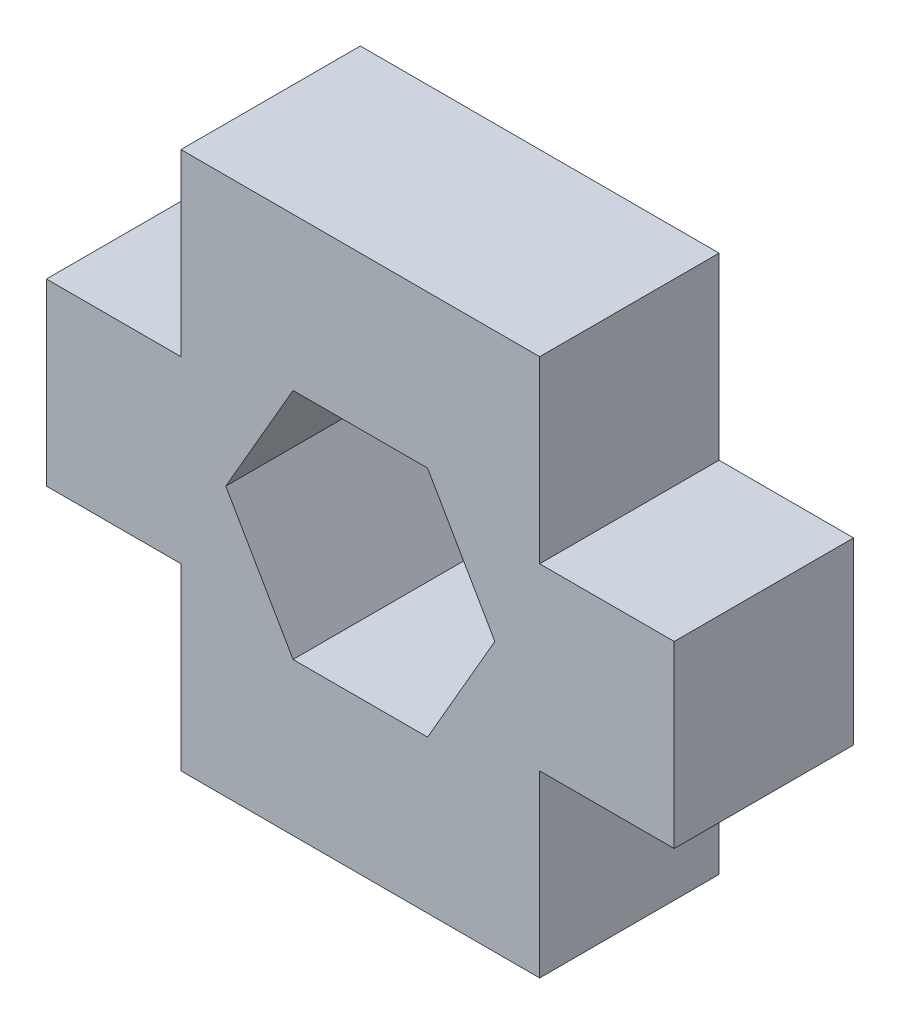
ISO-10303-21;
HEADER;
FILE_DESCRIPTION(('STEP AP214'),'2;1');
FILE_NAME('part.step','',(''),(''),'','','');
FILE_SCHEMA(('AUTOMOTIVE_DESIGN { 1 0 10303 214 1 1 1 1 }'));
ENDSEC;
DATA;
#1=APPLICATION_CONTEXT('core data for automotive mechanical design processes');
#2=APPLICATION_PROTOCOL_DEFINITION('international standard','automotive_design',2000,#1);
#3=PRODUCT_CONTEXT('',#1,'mechanical');
#4=PRODUCT('Part','Part','',(#3));
#5=PRODUCT_RELATED_PRODUCT_CATEGORY('part','',(#4));
#6=PRODUCT_DEFINITION_FORMATION('','',#4);
#7=PRODUCT_DEFINITION_CONTEXT('part definition',#1,'design');
#8=PRODUCT_DEFINITION('design','',#6,#7);
#9=PRODUCT_DEFINITION_SHAPE('','',#8);
#10=(LENGTH_UNIT() NAMED_UNIT(*) SI_UNIT(.MILLI.,.METRE.));
#11=(NAMED_UNIT(*) PLANE_ANGLE_UNIT() SI_UNIT($,.RADIAN.));
#12=(NAMED_UNIT(*) SI_UNIT($,.STERADIAN.) SOLID_ANGLE_UNIT());
#13=UNCERTAINTY_MEASURE_WITH_UNIT(LENGTH_MEASURE(1.E-05),#10,'distance_accuracy_value','');
#14=(GEOMETRIC_REPRESENTATION_CONTEXT(3) GLOBAL_UNCERTAINTY_ASSIGNED_CONTEXT((#13)) GLOBAL_UNIT_ASSIGNED_CONTEXT((#10,
#11,#12)) REPRESENTATION_CONTEXT('',''));
#15=CARTESIAN_POINT('',(0.,0.,0.));
#16=DIRECTION('',(0.,0.,1.));
#17=DIRECTION('',(1.,0.,0.));
#18=AXIS2_PLACEMENT_3D('',#15,#16,#17);
#19=CARTESIAN_POINT('',(0.,0.,4.));
#20=DIRECTION('',(0.,0.,1.));
#21=DIRECTION('',(1.,0.,0.));
#22=AXIS2_PLACEMENT_3D('',#19,#20,#21);
#23=PLANE('',#22);
#24=DIRECTION('',(0.,-1.,0.));
#25=VECTOR('',#24,1.);
#26=CARTESIAN_POINT('',(0.,4.,4.));
#27=LINE('',#26,#25);
#28=CARTESIAN_POINT('',(0.,4.,4.));
#29=VERTEX_POINT('',#28);
#30=CARTESIAN_POINT('',(0.,0.,4.));
#31=VERTEX_POINT('',#30);
#32=EDGE_CURVE('E208',#29,#31,#27,.T.);
#33=ORIENTED_EDGE('',*,*,#32,.T.);
#34=DIRECTION('',(1.,0.,0.));
#35=VECTOR('',#34,1.);
#36=CARTESIAN_POINT('',(0.,0.,4.));
#37=LINE('',#36,#35);
#38=CARTESIAN_POINT('',(8.,0.,4.));
#39=VERTEX_POINT('',#38);
#40=EDGE_CURVE('E211',#31,#39,#37,.T.);
#41=ORIENTED_EDGE('',*,*,#40,.T.);
#42=DIRECTION('',(0.,1.,0.));
#43=VECTOR('',#42,1.);
#44=CARTESIAN_POINT('',(8.,0.,4.));
#45=LINE('',#44,#43);
#46=CARTESIAN_POINT('',(8.,4.,4.));
#47=VERTEX_POINT('',#46);
#48=EDGE_CURVE('E214',#39,#47,#45,.T.);
#49=ORIENTED_EDGE('',*,*,#48,.T.);
#50=DIRECTION('',(1.,0.,0.));
#51=VECTOR('',#50,1.);
#52=CARTESIAN_POINT('',(8.,4.,4.));
#53=LINE('',#52,#51);
#54=CARTESIAN_POINT('',(11.,4.,4.));
#55=VERTEX_POINT('',#54);
#56=EDGE_CURVE('E216',#47,#55,#53,.T.);
#57=ORIENTED_EDGE('',*,*,#56,.T.);
#58=DIRECTION('',(0.,1.,0.));
#59=VECTOR('',#58,1.);
#60=CARTESIAN_POINT('',(11.,4.,4.));
#61=LINE('',#60,#59);
#62=CARTESIAN_POINT('',(11.,8.,4.));
#63=VERTEX_POINT('',#62);
#64=EDGE_CURVE('E218',#55,#63,#61,.T.);
#65=ORIENTED_EDGE('',*,*,#64,.T.);
#66=DIRECTION('',(-1.,0.,0.));
#67=VECTOR('',#66,1.);
#68=CARTESIAN_POINT('',(8.,8.,4.));
#69=LINE('',#68,#67);
#70=CARTESIAN_POINT('',(8.,8.,4.));
#71=VERTEX_POINT('',#70);
#72=EDGE_CURVE('E220',#63,#71,#69,.T.);
#73=ORIENTED_EDGE('',*,*,#72,.T.);
#74=DIRECTION('',(0.,1.,0.));
#75=VECTOR('',#74,1.);
#76=CARTESIAN_POINT('',(8.,8.,4.));
#77=LINE('',#76,#75);
#78=CARTESIAN_POINT('',(8.,12.,4.));
#79=VERTEX_POINT('',#78);
#80=EDGE_CURVE('E222',#71,#79,#77,.T.);
#81=ORIENTED_EDGE('',*,*,#80,.T.);
#82=DIRECTION('',(-1.,0.,0.));
#83=VECTOR('',#82,1.);
#84=CARTESIAN_POINT('',(8.,12.,4.));
#85=LINE('',#84,#83);
#86=CARTESIAN_POINT('',(0.,12.,4.));
#87=VERTEX_POINT('',#86);
#88=EDGE_CURVE('E224',#79,#87,#85,.T.);
#89=ORIENTED_EDGE('',*,*,#88,.T.);
#90=DIRECTION('',(0.,-1.,0.));
#91=VECTOR('',#90,1.);
#92=CARTESIAN_POINT('',(0.,12.,4.));
#93=LINE('',#92,#91);
#94=CARTESIAN_POINT('',(0.,8.,4.));
#95=VERTEX_POINT('',#94);
#96=EDGE_CURVE('E226',#87,#95,#93,.T.);
#97=ORIENTED_EDGE('',*,*,#96,.T.);
#98=DIRECTION('',(-1.,0.,0.));
#99=VECTOR('',#98,1.);
#100=CARTESIAN_POINT('',(0.,8.,4.));
#101=LINE('',#100,#99);
#102=CARTESIAN_POINT('',(-3.,8.,4.));
#103=VERTEX_POINT('',#102);
#104=EDGE_CURVE('E228',#95,#103,#101,.T.);
#105=ORIENTED_EDGE('',*,*,#104,.T.);
#106=DIRECTION('',(0.,-1.,0.));
#107=VECTOR('',#106,1.);
#108=CARTESIAN_POINT('',(-3.,8.,4.));
#109=LINE('',#108,#107);
#110=CARTESIAN_POINT('',(-3.,4.,4.));
#111=VERTEX_POINT('',#110);
#112=EDGE_CURVE('E230',#103,#111,#109,.T.);
#113=ORIENTED_EDGE('',*,*,#112,.T.);
#114=DIRECTION('',(1.,0.,0.));
#115=VECTOR('',#114,1.);
#116=CARTESIAN_POINT('',(-3.,4.,4.));
#117=LINE('',#116,#115);
#118=EDGE_CURVE('E232',#111,#29,#117,.T.);
#119=ORIENTED_EDGE('',*,*,#118,.T.);
#120=EDGE_LOOP('',(#33,#41,#49,#57,#65,#73,#81,#89,#97,#105,#113,#119));
#121=FACE_BOUND('',#120,.T.);
#122=DIRECTION('',(-0.5,0.866025403784439,0.));
#123=VECTOR('',#122,1.);
#124=CARTESIAN_POINT('',(7.00000000000003,5.99999999999998,4.));
#125=LINE('',#124,#123);
#126=CARTESIAN_POINT('',(7.00000000000003,5.99999999999998,4.));
#127=VERTEX_POINT('',#126);
#128=CARTESIAN_POINT('',(5.50000000000002,8.59807621135331,4.));
#129=VERTEX_POINT('',#128);
#130=EDGE_CURVE('E165',#127,#129,#125,.T.);
#131=ORIENTED_EDGE('',*,*,#130,.F.);
#132=DIRECTION('',(0.5,0.866025403784439,0.));
#133=VECTOR('',#132,1.);
#134=CARTESIAN_POINT('',(5.50000000000002,3.40192378864665,4.));
#135=LINE('',#134,#133);
#136=CARTESIAN_POINT('',(5.50000000000002,3.40192378864665,4.));
#137=VERTEX_POINT('',#136);
#138=EDGE_CURVE('E157',#137,#127,#135,.T.);
#139=ORIENTED_EDGE('',*,*,#138,.F.);
#140=DIRECTION('',(1.,0.,0.));
#141=VECTOR('',#140,1.);
#142=CARTESIAN_POINT('',(2.50000000000001,3.40192378864666,4.));
#143=LINE('',#142,#141);
#144=CARTESIAN_POINT('',(2.50000000000001,3.40192378864666,4.));
#145=VERTEX_POINT('',#144);
#146=EDGE_CURVE('E186',#145,#137,#143,.T.);
#147=ORIENTED_EDGE('',*,*,#146,.F.);
#148=DIRECTION('',(0.5,-0.866025403784438,0.));
#149=VECTOR('',#148,1.);
#150=CARTESIAN_POINT('',(1.,5.99999999999998,4.));
#151=LINE('',#150,#149);
#152=CARTESIAN_POINT('',(1.,5.99999999999998,4.));
#153=VERTEX_POINT('',#152);
#154=EDGE_CURVE('E184',#153,#145,#151,.T.);
#155=ORIENTED_EDGE('',*,*,#154,.F.);
#156=DIRECTION('',(-0.5,-0.866025403784439,0.));
#157=VECTOR('',#156,1.);
#158=CARTESIAN_POINT('',(2.50000000000001,8.59807621135331,4.));
#159=LINE('',#158,#157);
#160=CARTESIAN_POINT('',(2.50000000000001,8.59807621135331,4.));
#161=VERTEX_POINT('',#160);
#162=EDGE_CURVE('E180',#161,#153,#159,.T.);
#163=ORIENTED_EDGE('',*,*,#162,.F.);
#164=DIRECTION('',(-1.,0.,0.));
#165=VECTOR('',#164,1.);
#166=CARTESIAN_POINT('',(5.50000000000002,8.59807621135331,4.));
#167=LINE('',#166,#165);
#168=EDGE_CURVE('E178',#129,#161,#167,.T.);
#169=ORIENTED_EDGE('',*,*,#168,.F.);
#170=EDGE_LOOP('',(#131,#139,#147,#155,#163,#169));
#171=FACE_BOUND('',#170,.T.);
#172=ADVANCED_FACE('F32',(#121,#171),#23,.T.);
#173=CARTESIAN_POINT('',(0.,0.,0.));
#174=DIRECTION('',(0.,0.,1.));
#175=DIRECTION('',(1.,0.,0.));
#176=AXIS2_PLACEMENT_3D('',#173,#174,#175);
#177=PLANE('',#176);
#178=DIRECTION('',(0.,-1.,0.));
#179=VECTOR('',#178,1.);
#180=CARTESIAN_POINT('',(0.,4.,0.));
#181=LINE('',#180,#179);
#182=CARTESIAN_POINT('',(0.,4.,0.));
#183=VERTEX_POINT('',#182);
#184=CARTESIAN_POINT('',(0.,0.,0.));
#185=VERTEX_POINT('',#184);
#186=EDGE_CURVE('E173',#183,#185,#181,.T.);
#187=ORIENTED_EDGE('',*,*,#186,.F.);
#188=DIRECTION('',(1.,0.,0.));
#189=VECTOR('',#188,1.);
#190=CARTESIAN_POINT('',(-3.,4.,0.));
#191=LINE('',#190,#189);
#192=CARTESIAN_POINT('',(-3.,4.,0.));
#193=VERTEX_POINT('',#192);
#194=EDGE_CURVE('E212',#193,#183,#191,.T.);
#195=ORIENTED_EDGE('',*,*,#194,.F.);
#196=DIRECTION('',(0.,-1.,0.));
#197=VECTOR('',#196,1.);
#198=CARTESIAN_POINT('',(-3.,8.,0.));
#199=LINE('',#198,#197);
#200=CARTESIAN_POINT('',(-3.,8.,0.));
#201=VERTEX_POINT('',#200);
#202=EDGE_CURVE('E255',#201,#193,#199,.T.);
#203=ORIENTED_EDGE('',*,*,#202,.F.);
#204=DIRECTION('',(-1.,0.,0.));
#205=VECTOR('',#204,1.);
#206=CARTESIAN_POINT('',(0.,8.,0.));
#207=LINE('',#206,#205);
#208=CARTESIAN_POINT('',(0.,8.,0.));
#209=VERTEX_POINT('',#208);
#210=EDGE_CURVE('E253',#209,#201,#207,.T.);
#211=ORIENTED_EDGE('',*,*,#210,.F.);
#212=DIRECTION('',(0.,-1.,0.));
#213=VECTOR('',#212,1.);
#214=CARTESIAN_POINT('',(0.,12.,0.));
#215=LINE('',#214,#213);
#216=CARTESIAN_POINT('',(0.,12.,0.));
#217=VERTEX_POINT('',#216);
#218=EDGE_CURVE('E251',#217,#209,#215,.T.);
#219=ORIENTED_EDGE('',*,*,#218,.F.);
#220=DIRECTION('',(-1.,0.,0.));
#221=VECTOR('',#220,1.);
#222=CARTESIAN_POINT('',(8.,12.,0.));
#223=LINE('',#222,#221);
#224=CARTESIAN_POINT('',(8.,12.,0.));
#225=VERTEX_POINT('',#224);
#226=EDGE_CURVE('E249',#225,#217,#223,.T.);
#227=ORIENTED_EDGE('',*,*,#226,.F.);
#228=DIRECTION('',(0.,1.,0.));
#229=VECTOR('',#228,1.);
#230=CARTESIAN_POINT('',(8.,8.,0.));
#231=LINE('',#230,#229);
#232=CARTESIAN_POINT('',(8.,8.,0.));
#233=VERTEX_POINT('',#232);
#234=EDGE_CURVE('E247',#233,#225,#231,.T.);
#235=ORIENTED_EDGE('',*,*,#234,.F.);
#236=DIRECTION('',(-1.,0.,0.));
#237=VECTOR('',#236,1.);
#238=CARTESIAN_POINT('',(8.,8.,0.));
#239=LINE('',#238,#237);
#240=CARTESIAN_POINT('',(11.,8.,0.));
#241=VERTEX_POINT('',#240);
#242=EDGE_CURVE('E245',#241,#233,#239,.T.);
#243=ORIENTED_EDGE('',*,*,#242,.F.);
#244=DIRECTION('',(0.,1.,0.));
#245=VECTOR('',#244,1.);
#246=CARTESIAN_POINT('',(11.,4.,0.));
#247=LINE('',#246,#245);
#248=CARTESIAN_POINT('',(11.,4.,0.));
#249=VERTEX_POINT('',#248);
#250=EDGE_CURVE('E243',#249,#241,#247,.T.);
#251=ORIENTED_EDGE('',*,*,#250,.F.);
#252=DIRECTION('',(1.,0.,0.));
#253=VECTOR('',#252,1.);
#254=CARTESIAN_POINT('',(8.,4.,0.));
#255=LINE('',#254,#253);
#256=CARTESIAN_POINT('',(8.,4.,0.));
#257=VERTEX_POINT('',#256);
#258=EDGE_CURVE('E241',#257,#249,#255,.T.);
#259=ORIENTED_EDGE('',*,*,#258,.F.);
#260=DIRECTION('',(0.,1.,0.));
#261=VECTOR('',#260,1.);
#262=CARTESIAN_POINT('',(8.,0.,0.));
#263=LINE('',#262,#261);
#264=CARTESIAN_POINT('',(8.,0.,0.));
#265=VERTEX_POINT('',#264);
#266=EDGE_CURVE('E239',#265,#257,#263,.T.);
#267=ORIENTED_EDGE('',*,*,#266,.F.);
#268=DIRECTION('',(1.,0.,0.));
#269=VECTOR('',#268,1.);
#270=CARTESIAN_POINT('',(0.,0.,0.));
#271=LINE('',#270,#269);
#272=EDGE_CURVE('E237',#185,#265,#271,.T.);
#273=ORIENTED_EDGE('',*,*,#272,.F.);
#274=EDGE_LOOP('',(#187,#195,#203,#211,#219,#227,#235,#243,#251,#259,#267,#273));
#275=FACE_BOUND('',#274,.T.);
#276=DIRECTION('',(0.5,0.866025403784439,0.));
#277=VECTOR('',#276,1.);
#278=CARTESIAN_POINT('',(5.50000000000002,3.40192378864665,0.));
#279=LINE('',#278,#277);
#280=CARTESIAN_POINT('',(5.50000000000002,3.40192378864665,0.));
#281=VERTEX_POINT('',#280);
#282=CARTESIAN_POINT('',(7.00000000000003,5.99999999999998,0.));
#283=VERTEX_POINT('',#282);
#284=EDGE_CURVE('E55',#281,#283,#279,.T.);
#285=ORIENTED_EDGE('',*,*,#284,.T.);
#286=DIRECTION('',(-0.5,0.866025403784439,0.));
#287=VECTOR('',#286,1.);
#288=CARTESIAN_POINT('',(7.00000000000003,5.99999999999998,0.));
#289=LINE('',#288,#287);
#290=CARTESIAN_POINT('',(5.50000000000002,8.59807621135331,0.));
#291=VERTEX_POINT('',#290);
#292=EDGE_CURVE('E172',#283,#291,#289,.T.);
#293=ORIENTED_EDGE('',*,*,#292,.T.);
#294=DIRECTION('',(-1.,0.,0.));
#295=VECTOR('',#294,1.);
#296=CARTESIAN_POINT('',(5.50000000000002,8.59807621135331,0.));
#297=LINE('',#296,#295);
#298=CARTESIAN_POINT('',(2.50000000000001,8.59807621135331,0.));
#299=VERTEX_POINT('',#298);
#300=EDGE_CURVE('E190',#291,#299,#297,.T.);
#301=ORIENTED_EDGE('',*,*,#300,.T.);
#302=DIRECTION('',(-0.5,-0.866025403784439,0.));
#303=VECTOR('',#302,1.);
#304=CARTESIAN_POINT('',(2.50000000000001,8.59807621135331,0.));
#305=LINE('',#304,#303);
#306=CARTESIAN_POINT('',(1.,5.99999999999998,0.));
#307=VERTEX_POINT('',#306);
#308=EDGE_CURVE('E193',#299,#307,#305,.T.);
#309=ORIENTED_EDGE('',*,*,#308,.T.);
#310=DIRECTION('',(0.5,-0.866025403784438,0.));
#311=VECTOR('',#310,1.);
#312=CARTESIAN_POINT('',(1.,5.99999999999998,0.));
#313=LINE('',#312,#311);
#314=CARTESIAN_POINT('',(2.50000000000001,3.40192378864666,0.));
#315=VERTEX_POINT('',#314);
#316=EDGE_CURVE('E196',#307,#315,#313,.T.);
#317=ORIENTED_EDGE('',*,*,#316,.T.);
#318=DIRECTION('',(1.,0.,0.));
#319=VECTOR('',#318,1.);
#320=CARTESIAN_POINT('',(2.50000000000001,3.40192378864666,0.));
#321=LINE('',#320,#319);
#322=EDGE_CURVE('E166',#315,#281,#321,.T.);
#323=ORIENTED_EDGE('',*,*,#322,.T.);
#324=EDGE_LOOP('',(#285,#293,#301,#309,#317,#323));
#325=FACE_BOUND('',#324,.T.);
#326=ADVANCED_FACE('F297',(#275,#325),#177,.F.);
#327=CARTESIAN_POINT('',(0.,4.,4.));
#328=DIRECTION('',(1.,0.,0.));
#329=DIRECTION('',(0.,0.,-1.));
#330=AXIS2_PLACEMENT_3D('',#327,#328,#329);
#331=PLANE('',#330);
#332=ORIENTED_EDGE('',*,*,#186,.T.);
#333=DIRECTION('',(0.,0.,-1.));
#334=VECTOR('',#333,1.);
#335=CARTESIAN_POINT('',(0.,0.,4.));
#336=LINE('',#335,#334);
#337=EDGE_CURVE('E11',#31,#185,#336,.T.);
#338=ORIENTED_EDGE('',*,*,#337,.F.);
#339=ORIENTED_EDGE('',*,*,#32,.F.);
#340=DIRECTION('',(0.,0.,-1.));
#341=VECTOR('',#340,1.);
#342=CARTESIAN_POINT('',(0.,4.,4.));
#343=LINE('',#342,#341);
#344=EDGE_CURVE('E234',#29,#183,#343,.T.);
#345=ORIENTED_EDGE('',*,*,#344,.T.);
#346=EDGE_LOOP('',(#332,#338,#339,#345));
#347=FACE_BOUND('',#346,.T.);
#348=ADVANCED_FACE('F34',(#347),#331,.F.);
#349=CARTESIAN_POINT('',(0.,0.,4.));
#350=DIRECTION('',(0.,1.,0.));
#351=DIRECTION('',(0.,0.,1.));
#352=AXIS2_PLACEMENT_3D('',#349,#350,#351);
#353=PLANE('',#352);
#354=ORIENTED_EDGE('',*,*,#272,.T.);
#355=DIRECTION('',(0.,0.,-1.));
#356=VECTOR('',#355,1.);
#357=CARTESIAN_POINT('',(8.,0.,4.));
#358=LINE('',#357,#356);
#359=EDGE_CURVE('E40',#39,#265,#358,.T.);
#360=ORIENTED_EDGE('',*,*,#359,.F.);
#361=ORIENTED_EDGE('',*,*,#40,.F.);
#362=ORIENTED_EDGE('',*,*,#337,.T.);
#363=EDGE_LOOP('',(#354,#360,#361,#362));
#364=FACE_BOUND('',#363,.T.);
#365=ADVANCED_FACE('F314',(#364),#353,.F.);
#366=CARTESIAN_POINT('',(8.,0.,4.));
#367=DIRECTION('',(-1.,0.,0.));
#368=DIRECTION('',(0.,0.,1.));
#369=AXIS2_PLACEMENT_3D('',#366,#367,#368);
#370=PLANE('',#369);
#371=ORIENTED_EDGE('',*,*,#266,.T.);
#372=DIRECTION('',(0.,0.,-1.));
#373=VECTOR('',#372,1.);
#374=CARTESIAN_POINT('',(8.,4.,4.));
#375=LINE('',#374,#373);
#376=EDGE_CURVE('E284',#47,#257,#375,.T.);
#377=ORIENTED_EDGE('',*,*,#376,.F.);
#378=ORIENTED_EDGE('',*,*,#48,.F.);
#379=ORIENTED_EDGE('',*,*,#359,.T.);
#380=EDGE_LOOP('',(#371,#377,#378,#379));
#381=FACE_BOUND('',#380,.T.);
#382=ADVANCED_FACE('F291',(#381),#370,.F.);
#383=CARTESIAN_POINT('',(8.,4.,4.));
#384=DIRECTION('',(0.,1.,0.));
#385=DIRECTION('',(-1.,0.,0.));
#386=AXIS2_PLACEMENT_3D('',#383,#384,#385);
#387=PLANE('',#386);
#388=ORIENTED_EDGE('',*,*,#258,.T.);
#389=DIRECTION('',(0.,0.,-1.));
#390=VECTOR('',#389,1.);
#391=CARTESIAN_POINT('',(11.,4.,4.));
#392=LINE('',#391,#390);
#393=EDGE_CURVE('E281',#55,#249,#392,.T.);
#394=ORIENTED_EDGE('',*,*,#393,.F.);
#395=ORIENTED_EDGE('',*,*,#56,.F.);
#396=ORIENTED_EDGE('',*,*,#376,.T.);
#397=EDGE_LOOP('',(#388,#394,#395,#396));
#398=FACE_BOUND('',#397,.T.);
#399=ADVANCED_FACE('F303',(#398),#387,.F.);
#400=CARTESIAN_POINT('',(11.,4.,4.));
#401=DIRECTION('',(-1.,0.,0.));
#402=DIRECTION('',(0.,0.,1.));
#403=AXIS2_PLACEMENT_3D('',#400,#401,#402);
#404=PLANE('',#403);
#405=ORIENTED_EDGE('',*,*,#250,.T.);
#406=DIRECTION('',(0.,0.,-1.));
#407=VECTOR('',#406,1.);
#408=CARTESIAN_POINT('',(11.,8.,4.));
#409=LINE('',#408,#407);
#410=EDGE_CURVE('E278',#63,#241,#409,.T.);
#411=ORIENTED_EDGE('',*,*,#410,.F.);
#412=ORIENTED_EDGE('',*,*,#64,.F.);
#413=ORIENTED_EDGE('',*,*,#393,.T.);
#414=EDGE_LOOP('',(#405,#411,#412,#413));
#415=FACE_BOUND('',#414,.T.);
#416=ADVANCED_FACE('F307',(#415),#404,.F.);
#417=CARTESIAN_POINT('',(8.,8.,4.));
#418=DIRECTION('',(0.,-1.,0.));
#419=DIRECTION('',(0.,0.,-1.));
#420=AXIS2_PLACEMENT_3D('',#417,#418,#419);
#421=PLANE('',#420);
#422=ORIENTED_EDGE('',*,*,#242,.T.);
#423=DIRECTION('',(0.,0.,-1.));
#424=VECTOR('',#423,1.);
#425=CARTESIAN_POINT('',(8.,8.,4.));
#426=LINE('',#425,#424);
#427=EDGE_CURVE('E275',#71,#233,#426,.T.);
#428=ORIENTED_EDGE('',*,*,#427,.F.);
#429=ORIENTED_EDGE('',*,*,#72,.F.);
#430=ORIENTED_EDGE('',*,*,#410,.T.);
#431=EDGE_LOOP('',(#422,#428,#429,#430));
#432=FACE_BOUND('',#431,.T.);
#433=ADVANCED_FACE('F347',(#432),#421,.F.);
#434=CARTESIAN_POINT('',(8.,8.,4.));
#435=DIRECTION('',(-1.,0.,0.));
#436=DIRECTION('',(0.,0.,1.));
#437=AXIS2_PLACEMENT_3D('',#434,#435,#436);
#438=PLANE('',#437);
#439=ORIENTED_EDGE('',*,*,#234,.T.);
#440=DIRECTION('',(0.,0.,-1.));
#441=VECTOR('',#440,1.);
#442=CARTESIAN_POINT('',(8.,12.,4.));
#443=LINE('',#442,#441);
#444=EDGE_CURVE('E272',#79,#225,#443,.T.);
#445=ORIENTED_EDGE('',*,*,#444,.F.);
#446=ORIENTED_EDGE('',*,*,#80,.F.);
#447=ORIENTED_EDGE('',*,*,#427,.T.);
#448=EDGE_LOOP('',(#439,#445,#446,#447));
#449=FACE_BOUND('',#448,.T.);
#450=ADVANCED_FACE('F345',(#449),#438,.F.);
#451=CARTESIAN_POINT('',(8.,12.,4.));
#452=DIRECTION('',(0.,-1.,0.));
#453=DIRECTION('',(0.,0.,-1.));
#454=AXIS2_PLACEMENT_3D('',#451,#452,#453);
#455=PLANE('',#454);
#456=ORIENTED_EDGE('',*,*,#226,.T.);
#457=DIRECTION('',(0.,0.,-1.));
#458=VECTOR('',#457,1.);
#459=CARTESIAN_POINT('',(0.,12.,4.));
#460=LINE('',#459,#458);
#461=EDGE_CURVE('E269',#87,#217,#460,.T.);
#462=ORIENTED_EDGE('',*,*,#461,.F.);
#463=ORIENTED_EDGE('',*,*,#88,.F.);
#464=ORIENTED_EDGE('',*,*,#444,.T.);
#465=EDGE_LOOP('',(#456,#462,#463,#464));
#466=FACE_BOUND('',#465,.T.);
#467=ADVANCED_FACE('F341',(#466),#455,.F.);
#468=CARTESIAN_POINT('',(0.,12.,4.));
#469=DIRECTION('',(1.,0.,0.));
#470=DIRECTION('',(0.,0.,-1.));
#471=AXIS2_PLACEMENT_3D('',#468,#469,#470);
#472=PLANE('',#471);
#473=ORIENTED_EDGE('',*,*,#218,.T.);
#474=DIRECTION('',(0.,0.,-1.));
#475=VECTOR('',#474,1.);
#476=CARTESIAN_POINT('',(0.,8.,4.));
#477=LINE('',#476,#475);
#478=EDGE_CURVE('E266',#95,#209,#477,.T.);
#479=ORIENTED_EDGE('',*,*,#478,.F.);
#480=ORIENTED_EDGE('',*,*,#96,.F.);
#481=ORIENTED_EDGE('',*,*,#461,.T.);
#482=EDGE_LOOP('',(#473,#479,#480,#481));
#483=FACE_BOUND('',#482,.T.);
#484=ADVANCED_FACE('F336',(#483),#472,.F.);
#485=CARTESIAN_POINT('',(0.,8.,4.));
#486=DIRECTION('',(0.,-1.,0.));
#487=DIRECTION('',(0.,0.,-1.));
#488=AXIS2_PLACEMENT_3D('',#485,#486,#487);
#489=PLANE('',#488);
#490=ORIENTED_EDGE('',*,*,#210,.T.);
#491=DIRECTION('',(0.,0.,-1.));
#492=VECTOR('',#491,1.);
#493=CARTESIAN_POINT('',(-3.,8.,4.));
#494=LINE('',#493,#492);
#495=EDGE_CURVE('E263',#103,#201,#494,.T.);
#496=ORIENTED_EDGE('',*,*,#495,.F.);
#497=ORIENTED_EDGE('',*,*,#104,.F.);
#498=ORIENTED_EDGE('',*,*,#478,.T.);
#499=EDGE_LOOP('',(#490,#496,#497,#498));
#500=FACE_BOUND('',#499,.T.);
#501=ADVANCED_FACE('F330',(#500),#489,.F.);
#502=CARTESIAN_POINT('',(-3.,8.,4.));
#503=DIRECTION('',(1.,0.,0.));
#504=DIRECTION('',(0.,0.,-1.));
#505=AXIS2_PLACEMENT_3D('',#502,#503,#504);
#506=PLANE('',#505);
#507=ORIENTED_EDGE('',*,*,#202,.T.);
#508=DIRECTION('',(0.,0.,-1.));
#509=VECTOR('',#508,1.);
#510=CARTESIAN_POINT('',(-3.,4.,4.));
#511=LINE('',#510,#509);
#512=EDGE_CURVE('E260',#111,#193,#511,.T.);
#513=ORIENTED_EDGE('',*,*,#512,.F.);
#514=ORIENTED_EDGE('',*,*,#112,.F.);
#515=ORIENTED_EDGE('',*,*,#495,.T.);
#516=EDGE_LOOP('',(#507,#513,#514,#515));
#517=FACE_BOUND('',#516,.T.);
#518=ADVANCED_FACE('F326',(#517),#506,.F.);
#519=CARTESIAN_POINT('',(-3.,4.,4.));
#520=DIRECTION('',(0.,1.,0.));
#521=DIRECTION('',(0.,0.,1.));
#522=AXIS2_PLACEMENT_3D('',#519,#520,#521);
#523=PLANE('',#522);
#524=ORIENTED_EDGE('',*,*,#194,.T.);
#525=ORIENTED_EDGE('',*,*,#344,.F.);
#526=ORIENTED_EDGE('',*,*,#118,.F.);
#527=ORIENTED_EDGE('',*,*,#512,.T.);
#528=EDGE_LOOP('',(#524,#525,#526,#527));
#529=FACE_BOUND('',#528,.T.);
#530=ADVANCED_FACE('F321',(#529),#523,.F.);
#531=CARTESIAN_POINT('',(5.50000000000002,3.40192378864665,4.));
#532=DIRECTION('',(-0.866025403784439,0.5,0.));
#533=DIRECTION('',(-0.5,-0.866025403784439,0.));
#534=AXIS2_PLACEMENT_3D('',#531,#532,#533);
#535=PLANE('',#534);
#536=ORIENTED_EDGE('',*,*,#284,.F.);
#537=DIRECTION('',(0.,0.,-1.));
#538=VECTOR('',#537,1.);
#539=CARTESIAN_POINT('',(5.50000000000002,3.40192378864665,4.));
#540=LINE('',#539,#538);
#541=EDGE_CURVE('E161',#137,#281,#540,.T.);
#542=ORIENTED_EDGE('',*,*,#541,.F.);
#543=ORIENTED_EDGE('',*,*,#138,.T.);
#544=DIRECTION('',(0.,0.,-1.));
#545=VECTOR('',#544,1.);
#546=CARTESIAN_POINT('',(7.00000000000003,5.99999999999998,4.));
#547=LINE('',#546,#545);
#548=EDGE_CURVE('E160',#127,#283,#547,.T.);
#549=ORIENTED_EDGE('',*,*,#548,.T.);
#550=EDGE_LOOP('',(#536,#542,#543,#549));
#551=FACE_BOUND('',#550,.T.);
#552=ADVANCED_FACE('F159',(#551),#535,.T.);
#553=CARTESIAN_POINT('',(7.00000000000003,5.99999999999998,4.));
#554=DIRECTION('',(-0.866025403784439,-0.5,0.));
#555=DIRECTION('',(0.5,-0.866025403784439,0.));
#556=AXIS2_PLACEMENT_3D('',#553,#554,#555);
#557=PLANE('',#556);
#558=ORIENTED_EDGE('',*,*,#292,.F.);
#559=ORIENTED_EDGE('',*,*,#548,.F.);
#560=ORIENTED_EDGE('',*,*,#130,.T.);
#561=DIRECTION('',(0.,0.,-1.));
#562=VECTOR('',#561,1.);
#563=CARTESIAN_POINT('',(5.50000000000002,8.59807621135331,4.));
#564=LINE('',#563,#562);
#565=EDGE_CURVE('E174',#129,#291,#564,.T.);
#566=ORIENTED_EDGE('',*,*,#565,.T.);
#567=EDGE_LOOP('',(#558,#559,#560,#566));
#568=FACE_BOUND('',#567,.T.);
#569=ADVANCED_FACE('F169',(#568),#557,.T.);
#570=CARTESIAN_POINT('',(5.50000000000002,8.59807621135331,4.));
#571=DIRECTION('',(0.,-1.,0.));
#572=DIRECTION('',(1.,0.,0.));
#573=AXIS2_PLACEMENT_3D('',#570,#571,#572);
#574=PLANE('',#573);
#575=ORIENTED_EDGE('',*,*,#300,.F.);
#576=ORIENTED_EDGE('',*,*,#565,.F.);
#577=ORIENTED_EDGE('',*,*,#168,.T.);
#578=DIRECTION('',(0.,0.,-1.));
#579=VECTOR('',#578,1.);
#580=CARTESIAN_POINT('',(2.50000000000001,8.59807621135331,4.));
#581=LINE('',#580,#579);
#582=EDGE_CURVE('E205',#161,#299,#581,.T.);
#583=ORIENTED_EDGE('',*,*,#582,.T.);
#584=EDGE_LOOP('',(#575,#576,#577,#583));
#585=FACE_BOUND('',#584,.T.);
#586=ADVANCED_FACE('F405',(#585),#574,.T.);
#587=CARTESIAN_POINT('',(2.50000000000001,8.59807621135331,4.));
#588=DIRECTION('',(0.866025403784439,-0.5,0.));
#589=DIRECTION('',(0.5,0.866025403784439,0.));
#590=AXIS2_PLACEMENT_3D('',#587,#588,#589);
#591=PLANE('',#590);
#592=ORIENTED_EDGE('',*,*,#308,.F.);
#593=ORIENTED_EDGE('',*,*,#582,.F.);
#594=ORIENTED_EDGE('',*,*,#162,.T.);
#595=DIRECTION('',(0.,0.,-1.));
#596=VECTOR('',#595,1.);
#597=CARTESIAN_POINT('',(1.,5.99999999999998,4.));
#598=LINE('',#597,#596);
#599=EDGE_CURVE('E203',#153,#307,#598,.T.);
#600=ORIENTED_EDGE('',*,*,#599,.T.);
#601=EDGE_LOOP('',(#592,#593,#594,#600));
#602=FACE_BOUND('',#601,.T.);
#603=ADVANCED_FACE('F411',(#602),#591,.T.);
#604=CARTESIAN_POINT('',(1.,5.99999999999998,4.));
#605=DIRECTION('',(0.866025403784438,0.5,0.));
#606=DIRECTION('',(-0.5,0.866025403784439,0.));
#607=AXIS2_PLACEMENT_3D('',#604,#605,#606);
#608=PLANE('',#607);
#609=ORIENTED_EDGE('',*,*,#316,.F.);
#610=ORIENTED_EDGE('',*,*,#599,.F.);
#611=ORIENTED_EDGE('',*,*,#154,.T.);
#612=DIRECTION('',(0.,0.,-1.));
#613=VECTOR('',#612,1.);
#614=CARTESIAN_POINT('',(2.50000000000001,3.40192378864666,4.));
#615=LINE('',#614,#613);
#616=EDGE_CURVE('E47',#145,#315,#615,.T.);
#617=ORIENTED_EDGE('',*,*,#616,.T.);
#618=EDGE_LOOP('',(#609,#610,#611,#617));
#619=FACE_BOUND('',#618,.T.);
#620=ADVANCED_FACE('F419',(#619),#608,.T.);
#621=CARTESIAN_POINT('',(2.50000000000001,3.40192378864666,4.));
#622=DIRECTION('',(0.,1.,0.));
#623=DIRECTION('',(-1.,0.,0.));
#624=AXIS2_PLACEMENT_3D('',#621,#622,#623);
#625=PLANE('',#624);
#626=ORIENTED_EDGE('',*,*,#322,.F.);
#627=ORIENTED_EDGE('',*,*,#616,.F.);
#628=ORIENTED_EDGE('',*,*,#146,.T.);
#629=ORIENTED_EDGE('',*,*,#541,.T.);
#630=EDGE_LOOP('',(#626,#627,#628,#629));
#631=FACE_BOUND('',#630,.T.);
#632=ADVANCED_FACE('F427',(#631),#625,.T.);
#633=CLOSED_SHELL('',(#172,#326,#348,#365,#382,#399,#416,#433,#450,#467,#484,#501,#518,#530,
#552,#569,#586,#603,#620,#632));
#634=MANIFOLD_SOLID_BREP('B2',#633);
#635=ADVANCED_BREP_SHAPE_REPRESENTATION('',(#18,#634),#14);
#636=SHAPE_DEFINITION_REPRESENTATION(#9,#635);
ENDSEC;
END-ISO-10303-21;
